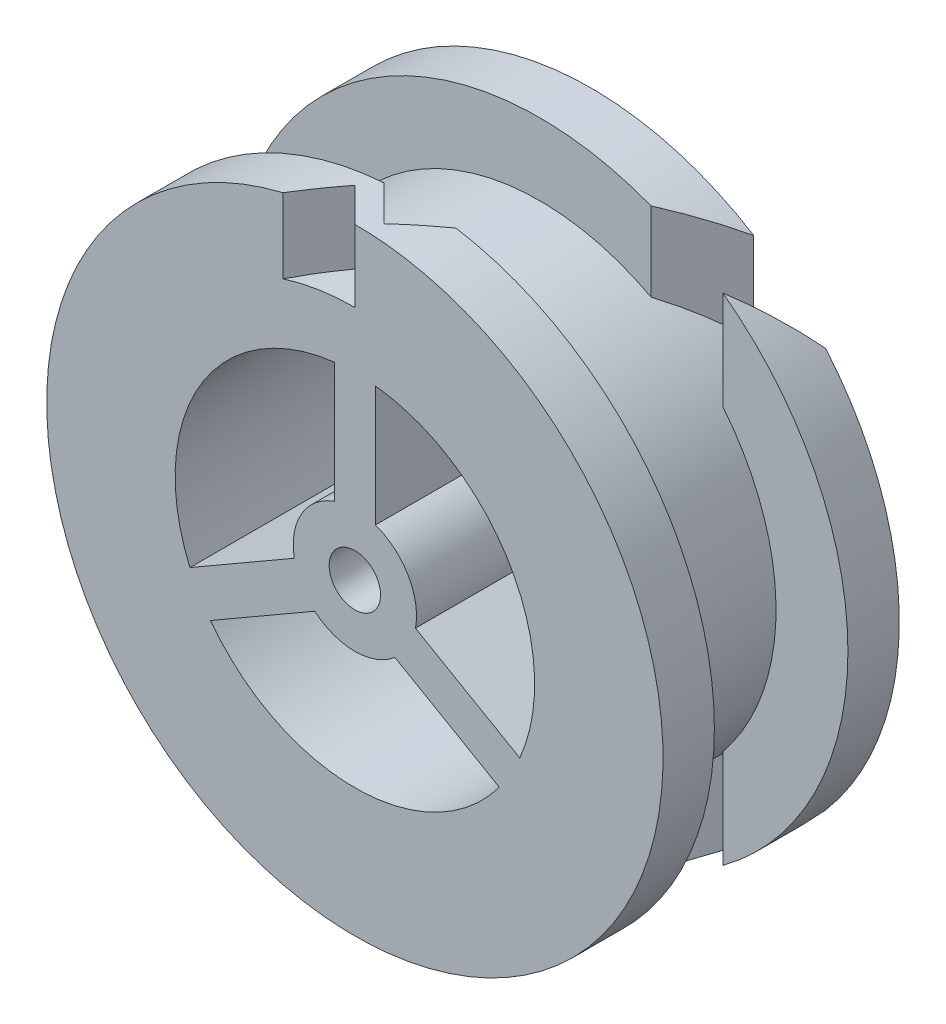
ISO-10303-21;
HEADER;
FILE_DESCRIPTION(('STEP AP214'),'2;1');
FILE_NAME('part.step','',(''),(''),'','','');
FILE_SCHEMA(('AUTOMOTIVE_DESIGN { 1 0 10303 214 1 1 1 1 }'));
ENDSEC;
DATA;
#1=APPLICATION_CONTEXT('core data for automotive mechanical design processes');
#2=APPLICATION_PROTOCOL_DEFINITION('international standard','automotive_design',2000,#1);
#3=PRODUCT_CONTEXT('',#1,'mechanical');
#4=PRODUCT('Part','Part','',(#3));
#5=PRODUCT_RELATED_PRODUCT_CATEGORY('part','',(#4));
#6=PRODUCT_DEFINITION_FORMATION('','',#4);
#7=PRODUCT_DEFINITION_CONTEXT('part definition',#1,'design');
#8=PRODUCT_DEFINITION('design','',#6,#7);
#9=PRODUCT_DEFINITION_SHAPE('','',#8);
#10=(LENGTH_UNIT() NAMED_UNIT(*) SI_UNIT(.MILLI.,.METRE.));
#11=(NAMED_UNIT(*) PLANE_ANGLE_UNIT() SI_UNIT($,.RADIAN.));
#12=(NAMED_UNIT(*) SI_UNIT($,.STERADIAN.) SOLID_ANGLE_UNIT());
#13=UNCERTAINTY_MEASURE_WITH_UNIT(LENGTH_MEASURE(1.E-05),#10,'distance_accuracy_value','');
#14=(GEOMETRIC_REPRESENTATION_CONTEXT(3) GLOBAL_UNCERTAINTY_ASSIGNED_CONTEXT((#13)) GLOBAL_UNIT_ASSIGNED_CONTEXT((#10,
#11,#12)) REPRESENTATION_CONTEXT('',''));
#15=CARTESIAN_POINT('',(0.,0.,0.));
#16=DIRECTION('',(0.,0.,1.));
#17=DIRECTION('',(1.,0.,0.));
#18=AXIS2_PLACEMENT_3D('',#15,#16,#17);
#19=CARTESIAN_POINT('',(0.,0.,-11.5));
#20=DIRECTION('',(0.,0.,1.));
#21=DIRECTION('',(1.,0.,0.));
#22=AXIS2_PLACEMENT_3D('',#19,#20,#21);
#23=CYLINDRICAL_SURFACE('',#22,30.);
#24=CARTESIAN_POINT('',(0.,0.,4.32842712474612));
#25=DIRECTION('',(-0.707106781186553,0.,-0.707106781186542));
#26=DIRECTION('',(-0.707106781186542,0.,0.707106781186553));
#27=AXIS2_PLACEMENT_3D('',#24,#25,#26);
#28=ELLIPSE('',#27,42.4264068711932,30.);
#29=CARTESIAN_POINT('',(10.828427124746,-27.977583276689,-6.50000000000001));
#30=VERTEX_POINT('',#29);
#31=CARTESIAN_POINT('',(15.8284271247459,-25.4845226511428,-11.5));
#32=VERTEX_POINT('',#31);
#33=EDGE_CURVE('E537',#30,#32,#28,.F.);
#34=ORIENTED_EDGE('',*,*,#33,.F.);
#35=CARTESIAN_POINT('',(0.,0.,-6.50000000000001));
#36=DIRECTION('',(0.,0.,1.));
#37=DIRECTION('',(1.,0.,0.));
#38=AXIS2_PLACEMENT_3D('',#35,#36,#37);
#39=CIRCLE('',#38,30.);
#40=CARTESIAN_POINT('',(10.828427124746,27.977583276689,-6.50000000000001));
#41=VERTEX_POINT('',#40);
#42=EDGE_CURVE('E349',#30,#41,#39,.F.);
#43=ORIENTED_EDGE('',*,*,#42,.T.);
#44=CARTESIAN_POINT('',(15.8284271247459,25.4845226511428,-11.5));
#45=VERTEX_POINT('',#44);
#46=EDGE_CURVE('E541',#45,#41,#28,.F.);
#47=ORIENTED_EDGE('',*,*,#46,.F.);
#48=CARTESIAN_POINT('',(0.,0.,-11.5));
#49=DIRECTION('',(0.,0.,1.));
#50=DIRECTION('',(1.,0.,0.));
#51=AXIS2_PLACEMENT_3D('',#48,#49,#50);
#52=CIRCLE('',#51,30.);
#53=EDGE_CURVE('E293',#45,#32,#52,.T.);
#54=ORIENTED_EDGE('',*,*,#53,.T.);
#55=EDGE_LOOP('',(#34,#43,#47,#54));
#56=FACE_BOUND('',#55,.T.);
#57=ADVANCED_FACE('F39',(#56),#23,.T.);
#58=CARTESIAN_POINT('',(0.,0.,-6.5));
#59=DIRECTION('',(0.,0.,1.));
#60=DIRECTION('',(1.,0.,0.));
#61=AXIS2_PLACEMENT_3D('',#58,#59,#60);
#62=PLANE('',#61);
#63=DIRECTION('',(0.,-1.,0.));
#64=VECTOR('',#63,1.);
#65=CARTESIAN_POINT('',(10.828427124746,0.,-6.5));
#66=LINE('',#65,#64);
#67=CARTESIAN_POINT('',(10.828427124746,20.2915047742661,-6.50000000000001));
#68=VERTEX_POINT('',#67);
#69=EDGE_CURVE('E538',#41,#68,#66,.T.);
#70=ORIENTED_EDGE('',*,*,#69,.F.);
#71=ORIENTED_EDGE('',*,*,#42,.F.);
#72=CARTESIAN_POINT('',(10.828427124746,-20.2915047742661,-6.50000000000001));
#73=VERTEX_POINT('',#72);
#74=EDGE_CURVE('E535',#73,#30,#66,.T.);
#75=ORIENTED_EDGE('',*,*,#74,.F.);
#76=CARTESIAN_POINT('',(0.,0.,-6.50000000000001));
#77=DIRECTION('',(0.,0.,1.));
#78=DIRECTION('',(1.,0.,0.));
#79=AXIS2_PLACEMENT_3D('',#76,#77,#78);
#80=CIRCLE('',#79,23.);
#81=EDGE_CURVE('E353',#73,#68,#80,.F.);
#82=ORIENTED_EDGE('',*,*,#81,.T.);
#83=EDGE_LOOP('',(#70,#71,#75,#82));
#84=FACE_BOUND('',#83,.T.);
#85=ADVANCED_FACE('F435',(#84),#62,.T.);
#86=CARTESIAN_POINT('',(0.,0.,6.5));
#87=DIRECTION('',(0.,0.,1.));
#88=DIRECTION('',(1.,0.,0.));
#89=AXIS2_PLACEMENT_3D('',#86,#87,#88);
#90=PLANE('',#89);
#91=CARTESIAN_POINT('',(0.,0.,6.50000000000001));
#92=DIRECTION('',(0.,0.,1.));
#93=DIRECTION('',(1.,0.,0.));
#94=AXIS2_PLACEMENT_3D('',#91,#92,#93);
#95=CIRCLE('',#94,30.);
#96=CARTESIAN_POINT('',(-2.17157287525385,29.9213012960242,6.50000000000001));
#97=VERTEX_POINT('',#96);
#98=CARTESIAN_POINT('',(-2.17157287525385,-29.9213012960242,6.50000000000001));
#99=VERTEX_POINT('',#98);
#100=EDGE_CURVE('E340',#97,#99,#95,.T.);
#101=ORIENTED_EDGE('',*,*,#100,.F.);
#102=DIRECTION('',(0.,1.,0.));
#103=VECTOR('',#102,1.);
#104=CARTESIAN_POINT('',(-2.17157287525385,-30.001,6.50000000000001));
#105=LINE('',#104,#103);
#106=CARTESIAN_POINT('',(-2.17157287525385,22.8972546661704,6.50000000000001));
#107=VERTEX_POINT('',#106);
#108=EDGE_CURVE('E499',#107,#97,#105,.T.);
#109=ORIENTED_EDGE('',*,*,#108,.F.);
#110=CARTESIAN_POINT('',(0.,0.,6.50000000000001));
#111=DIRECTION('',(0.,0.,1.));
#112=DIRECTION('',(1.,0.,0.));
#113=AXIS2_PLACEMENT_3D('',#110,#111,#112);
#114=CIRCLE('',#113,23.);
#115=CARTESIAN_POINT('',(-2.17157287525385,-22.8972546661704,6.50000000000001));
#116=VERTEX_POINT('',#115);
#117=EDGE_CURVE('E341',#107,#116,#114,.T.);
#118=ORIENTED_EDGE('',*,*,#117,.T.);
#119=DIRECTION('',(0.,-1.,0.));
#120=VECTOR('',#119,1.);
#121=CARTESIAN_POINT('',(-2.17157287525386,0.,6.5));
#122=LINE('',#121,#120);
#123=EDGE_CURVE('E296',#116,#99,#122,.T.);
#124=ORIENTED_EDGE('',*,*,#123,.T.);
#125=EDGE_LOOP('',(#101,#109,#118,#124));
#126=FACE_BOUND('',#125,.T.);
#127=ADVANCED_FACE('F442',(#126),#90,.F.);
#128=CARTESIAN_POINT('',(0.,0.,11.3284271247462));
#129=DIRECTION('',(0.707106781186553,0.,0.707106781186542));
#130=DIRECTION('',(-0.707106781186542,0.,0.707106781186553));
#131=AXIS2_PLACEMENT_3D('',#128,#129,#130);
#132=ELLIPSE('',#131,42.4264068711932,30.);
#133=CARTESIAN_POINT('',(17.8284271247459,24.1277265041202,-6.50000000000001));
#134=VERTEX_POINT('',#133);
#135=CARTESIAN_POINT('',(22.8284271247459,19.4644012240338,-11.5));
#136=VERTEX_POINT('',#135);
#137=EDGE_CURVE('E527',#134,#136,#132,.F.);
#138=ORIENTED_EDGE('',*,*,#137,.F.);
#139=CARTESIAN_POINT('',(17.8284271247459,-24.1277265041202,-6.50000000000001));
#140=VERTEX_POINT('',#139);
#141=EDGE_CURVE('E343',#134,#140,#39,.F.);
#142=ORIENTED_EDGE('',*,*,#141,.T.);
#143=CARTESIAN_POINT('',(22.8284271247459,-19.4644012240338,-11.5));
#144=VERTEX_POINT('',#143);
#145=EDGE_CURVE('E531',#144,#140,#132,.F.);
#146=ORIENTED_EDGE('',*,*,#145,.F.);
#147=EDGE_CURVE('E290',#144,#136,#52,.T.);
#148=ORIENTED_EDGE('',*,*,#147,.T.);
#149=EDGE_LOOP('',(#138,#142,#146,#148));
#150=FACE_BOUND('',#149,.T.);
#151=ADVANCED_FACE('F438',(#150),#23,.T.);
#152=CARTESIAN_POINT('',(-1.00000000000001,1.73205080756888,-11.5));
#153=DIRECTION('',(0.500000000000004,-0.866025403784436,0.));
#154=DIRECTION('',(0.866025403784436,0.500000000000005,0.));
#155=AXIS2_PLACEMENT_3D('',#152,#153,#154);
#156=PLANE('',#155);
#157=DIRECTION('',(0.,0.,1.));
#158=VECTOR('',#157,1.);
#159=CARTESIAN_POINT('',(-16.0561449249135,-6.96061851778806,-11.5));
#160=LINE('',#159,#158);
#161=CARTESIAN_POINT('',(-16.0561449249135,-6.96061851778806,-11.5));
#162=VERTEX_POINT('',#161);
#163=CARTESIAN_POINT('',(-16.0561449249135,-6.96061851778806,11.5));
#164=VERTEX_POINT('',#163);
#165=EDGE_CURVE('E301',#162,#164,#160,.T.);
#166=ORIENTED_EDGE('',*,*,#165,.T.);
#167=DIRECTION('',(0.866025403784436,0.500000000000005,0.));
#168=VECTOR('',#167,1.);
#169=CARTESIAN_POINT('',(-1.00000000000001,1.73205080756888,11.5));
#170=LINE('',#169,#168);
#171=CARTESIAN_POINT('',(-5.89897948556635,-1.09637631717734,11.5));
#172=VERTEX_POINT('',#171);
#173=EDGE_CURVE('E374',#164,#172,#170,.T.);
#174=ORIENTED_EDGE('',*,*,#173,.T.);
#175=DIRECTION('',(0.,0.,1.));
#176=VECTOR('',#175,1.);
#177=CARTESIAN_POINT('',(-5.89897948556635,-1.09637631717734,-11.5));
#178=LINE('',#177,#176);
#179=CARTESIAN_POINT('',(-5.89897948556635,-1.09637631717734,-11.5));
#180=VERTEX_POINT('',#179);
#181=EDGE_CURVE('E294',#180,#172,#178,.T.);
#182=ORIENTED_EDGE('',*,*,#181,.F.);
#183=DIRECTION('',(0.866025403784436,0.500000000000005,0.));
#184=VECTOR('',#183,1.);
#185=CARTESIAN_POINT('',(-1.00000000000001,1.73205080756888,-11.5));
#186=LINE('',#185,#184);
#187=EDGE_CURVE('E286',#162,#180,#186,.T.);
#188=ORIENTED_EDGE('',*,*,#187,.F.);
#189=EDGE_LOOP('',(#166,#174,#182,#188));
#190=FACE_BOUND('',#189,.T.);
#191=ADVANCED_FACE('F414',(#190),#156,.F.);
#192=CARTESIAN_POINT('',(0.,0.,-11.5));
#193=DIRECTION('',(0.,0.,1.));
#194=DIRECTION('',(1.,0.,0.));
#195=AXIS2_PLACEMENT_3D('',#192,#193,#194);
#196=CYLINDRICAL_SURFACE('',#195,6.);
#197=ORIENTED_EDGE('',*,*,#181,.T.);
#198=CARTESIAN_POINT('',(0.,0.,11.5));
#199=DIRECTION('',(0.,0.,1.));
#200=DIRECTION('',(1.,0.,0.));
#201=AXIS2_PLACEMENT_3D('',#198,#199,#200);
#202=CIRCLE('',#201,6.);
#203=CARTESIAN_POINT('',(-2.,5.65685424949238,11.5));
#204=VERTEX_POINT('',#203);
#205=EDGE_CURVE('E256',#204,#172,#202,.T.);
#206=ORIENTED_EDGE('',*,*,#205,.F.);
#207=DIRECTION('',(0.,0.,1.));
#208=VECTOR('',#207,1.);
#209=CARTESIAN_POINT('',(-2.,5.65685424949238,-11.5));
#210=LINE('',#209,#208);
#211=CARTESIAN_POINT('',(-2.,5.65685424949238,-11.5));
#212=VERTEX_POINT('',#211);
#213=EDGE_CURVE('E297',#212,#204,#210,.T.);
#214=ORIENTED_EDGE('',*,*,#213,.F.);
#215=CARTESIAN_POINT('',(0.,0.,-11.5));
#216=DIRECTION('',(0.,0.,1.));
#217=DIRECTION('',(1.,0.,0.));
#218=AXIS2_PLACEMENT_3D('',#215,#216,#217);
#219=CIRCLE('',#218,6.);
#220=EDGE_CURVE('E276',#212,#180,#219,.T.);
#221=ORIENTED_EDGE('',*,*,#220,.T.);
#222=EDGE_LOOP('',(#197,#206,#214,#221));
#223=FACE_BOUND('',#222,.T.);
#224=ADVANCED_FACE('F418',(#223),#196,.T.);
#225=CARTESIAN_POINT('',(-2.,0.,-11.5));
#226=DIRECTION('',(1.,0.,0.));
#227=DIRECTION('',(0.,0.,-1.));
#228=AXIS2_PLACEMENT_3D('',#225,#226,#227);
#229=PLANE('',#228);
#230=ORIENTED_EDGE('',*,*,#213,.T.);
#231=DIRECTION('',(0.,1.,0.));
#232=VECTOR('',#231,1.);
#233=CARTESIAN_POINT('',(-2.,0.,11.5));
#234=LINE('',#233,#232);
#235=CARTESIAN_POINT('',(-2.,17.3853386507137,11.5));
#236=VERTEX_POINT('',#235);
#237=EDGE_CURVE('E264',#204,#236,#234,.T.);
#238=ORIENTED_EDGE('',*,*,#237,.T.);
#239=DIRECTION('',(0.,0.,1.));
#240=VECTOR('',#239,1.);
#241=CARTESIAN_POINT('',(-2.,17.3853386507137,-11.5));
#242=LINE('',#241,#240);
#243=CARTESIAN_POINT('',(-2.,17.3853386507137,-11.5));
#244=VERTEX_POINT('',#243);
#245=EDGE_CURVE('E299',#244,#236,#242,.T.);
#246=ORIENTED_EDGE('',*,*,#245,.F.);
#247=DIRECTION('',(0.,1.,0.));
#248=VECTOR('',#247,1.);
#249=CARTESIAN_POINT('',(-2.,0.,-11.5));
#250=LINE('',#249,#248);
#251=EDGE_CURVE('E288',#212,#244,#250,.T.);
#252=ORIENTED_EDGE('',*,*,#251,.F.);
#253=EDGE_LOOP('',(#230,#238,#246,#252));
#254=FACE_BOUND('',#253,.T.);
#255=ADVANCED_FACE('F745',(#254),#229,.F.);
#256=CARTESIAN_POINT('',(0.,0.,-11.5));
#257=DIRECTION('',(0.,0.,1.));
#258=DIRECTION('',(1.,0.,0.));
#259=AXIS2_PLACEMENT_3D('',#256,#257,#258);
#260=CYLINDRICAL_SURFACE('',#259,17.5);
#261=DIRECTION('',(0.,0.,1.));
#262=VECTOR('',#261,1.);
#263=CARTESIAN_POINT('',(-14.0561449249135,-10.4247201329258,-11.5));
#264=LINE('',#263,#262);
#265=CARTESIAN_POINT('',(-14.0561449249135,-10.4247201329258,-11.5));
#266=VERTEX_POINT('',#265);
#267=CARTESIAN_POINT('',(-14.0561449249135,-10.4247201329258,11.5));
#268=VERTEX_POINT('',#267);
#269=EDGE_CURVE('E309',#266,#268,#264,.T.);
#270=ORIENTED_EDGE('',*,*,#269,.T.);
#271=CARTESIAN_POINT('',(0.,0.,11.5));
#272=DIRECTION('',(0.,0.,1.));
#273=DIRECTION('',(1.,0.,0.));
#274=AXIS2_PLACEMENT_3D('',#271,#272,#273);
#275=CIRCLE('',#274,17.5);
#276=CARTESIAN_POINT('',(14.0561449249136,-10.4247201329257,11.5));
#277=VERTEX_POINT('',#276);
#278=EDGE_CURVE('E359',#268,#277,#275,.T.);
#279=ORIENTED_EDGE('',*,*,#278,.T.);
#280=DIRECTION('',(0.,0.,1.));
#281=VECTOR('',#280,1.);
#282=CARTESIAN_POINT('',(14.0561449249136,-10.4247201329257,-11.5));
#283=LINE('',#282,#281);
#284=CARTESIAN_POINT('',(14.0561449249136,-10.4247201329257,-11.5));
#285=VERTEX_POINT('',#284);
#286=EDGE_CURVE('E303',#285,#277,#283,.T.);
#287=ORIENTED_EDGE('',*,*,#286,.F.);
#288=CARTESIAN_POINT('',(0.,0.,-11.5));
#289=DIRECTION('',(0.,0.,1.));
#290=DIRECTION('',(1.,0.,0.));
#291=AXIS2_PLACEMENT_3D('',#288,#289,#290);
#292=CIRCLE('',#291,17.5);
#293=EDGE_CURVE('E262',#266,#285,#292,.T.);
#294=ORIENTED_EDGE('',*,*,#293,.F.);
#295=EDGE_LOOP('',(#270,#279,#287,#294));
#296=FACE_BOUND('',#295,.T.);
#297=ADVANCED_FACE('F389',(#296),#260,.F.);
#298=CARTESIAN_POINT('',(-0.999999999999993,-1.73205080756888,-11.5));
#299=DIRECTION('',(0.499999999999998,0.86602540378444,0.));
#300=DIRECTION('',(-0.86602540378444,0.499999999999998,0.));
#301=AXIS2_PLACEMENT_3D('',#298,#299,#300);
#302=PLANE('',#301);
#303=ORIENTED_EDGE('',*,*,#286,.T.);
#304=DIRECTION('',(-0.86602540378444,0.499999999999998,0.));
#305=VECTOR('',#304,1.);
#306=CARTESIAN_POINT('',(-0.999999999999993,-1.73205080756888,11.5));
#307=LINE('',#306,#305);
#308=CARTESIAN_POINT('',(3.89897948556637,-4.56047793231505,11.5));
#309=VERTEX_POINT('',#308);
#310=EDGE_CURVE('E369',#277,#309,#307,.T.);
#311=ORIENTED_EDGE('',*,*,#310,.T.);
#312=DIRECTION('',(0.,0.,1.));
#313=VECTOR('',#312,1.);
#314=CARTESIAN_POINT('',(3.89897948556637,-4.56047793231505,-11.5));
#315=LINE('',#314,#313);
#316=CARTESIAN_POINT('',(3.89897948556637,-4.56047793231505,-11.5));
#317=VERTEX_POINT('',#316);
#318=EDGE_CURVE('E305',#317,#309,#315,.T.);
#319=ORIENTED_EDGE('',*,*,#318,.F.);
#320=DIRECTION('',(-0.86602540378444,0.499999999999998,0.));
#321=VECTOR('',#320,1.);
#322=CARTESIAN_POINT('',(-0.999999999999993,-1.73205080756888,-11.5));
#323=LINE('',#322,#321);
#324=EDGE_CURVE('E281',#285,#317,#323,.T.);
#325=ORIENTED_EDGE('',*,*,#324,.F.);
#326=EDGE_LOOP('',(#303,#311,#319,#325));
#327=FACE_BOUND('',#326,.T.);
#328=ADVANCED_FACE('F399',(#327),#302,.F.);
#329=ORIENTED_EDGE('',*,*,#318,.T.);
#330=CARTESIAN_POINT('',(-3.89897948556633,-4.56047793231509,11.5));
#331=VERTEX_POINT('',#330);
#332=EDGE_CURVE('E266',#331,#309,#202,.T.);
#333=ORIENTED_EDGE('',*,*,#332,.F.);
#334=DIRECTION('',(0.,0.,1.));
#335=VECTOR('',#334,1.);
#336=CARTESIAN_POINT('',(-3.89897948556633,-4.56047793231509,-11.5));
#337=LINE('',#336,#335);
#338=CARTESIAN_POINT('',(-3.89897948556633,-4.56047793231509,-11.5));
#339=VERTEX_POINT('',#338);
#340=EDGE_CURVE('E307',#339,#331,#337,.T.);
#341=ORIENTED_EDGE('',*,*,#340,.F.);
#342=EDGE_CURVE('E277',#339,#317,#219,.T.);
#343=ORIENTED_EDGE('',*,*,#342,.T.);
#344=EDGE_LOOP('',(#329,#333,#341,#343));
#345=FACE_BOUND('',#344,.T.);
#346=ADVANCED_FACE('F420',(#345),#196,.T.);
#347=DIRECTION('',(0.,0.,1.));
#348=VECTOR('',#347,1.);
#349=CARTESIAN_POINT('',(16.0561449249136,-6.96061851778794,-11.5));
#350=LINE('',#349,#348);
#351=CARTESIAN_POINT('',(16.0561449249136,-6.96061851778794,-11.5));
#352=VERTEX_POINT('',#351);
#353=CARTESIAN_POINT('',(16.0561449249136,-6.96061851778794,11.5));
#354=VERTEX_POINT('',#353);
#355=EDGE_CURVE('E317',#352,#354,#350,.T.);
#356=ORIENTED_EDGE('',*,*,#355,.T.);
#357=CARTESIAN_POINT('',(2.,17.3853386507137,11.5));
#358=VERTEX_POINT('',#357);
#359=EDGE_CURVE('E354',#354,#358,#275,.T.);
#360=ORIENTED_EDGE('',*,*,#359,.T.);
#361=DIRECTION('',(0.,0.,1.));
#362=VECTOR('',#361,1.);
#363=CARTESIAN_POINT('',(2.,17.3853386507137,-11.5));
#364=LINE('',#363,#362);
#365=CARTESIAN_POINT('',(2.,17.3853386507137,-11.5));
#366=VERTEX_POINT('',#365);
#367=EDGE_CURVE('E311',#366,#358,#364,.T.);
#368=ORIENTED_EDGE('',*,*,#367,.F.);
#369=EDGE_CURVE('E255',#352,#366,#292,.T.);
#370=ORIENTED_EDGE('',*,*,#369,.F.);
#371=EDGE_LOOP('',(#356,#360,#368,#370));
#372=FACE_BOUND('',#371,.T.);
#373=ADVANCED_FACE('F698',(#372),#260,.F.);
#374=CARTESIAN_POINT('',(2.,0.,-11.5));
#375=DIRECTION('',(-1.,0.,0.));
#376=DIRECTION('',(0.,-1.,0.));
#377=AXIS2_PLACEMENT_3D('',#374,#375,#376);
#378=PLANE('',#377);
#379=ORIENTED_EDGE('',*,*,#367,.T.);
#380=DIRECTION('',(0.,-1.,0.));
#381=VECTOR('',#380,1.);
#382=CARTESIAN_POINT('',(2.,0.,11.5));
#383=LINE('',#382,#381);
#384=CARTESIAN_POINT('',(2.,5.65685424949238,11.5));
#385=VERTEX_POINT('',#384);
#386=EDGE_CURVE('E363',#358,#385,#383,.T.);
#387=ORIENTED_EDGE('',*,*,#386,.T.);
#388=DIRECTION('',(0.,0.,1.));
#389=VECTOR('',#388,1.);
#390=CARTESIAN_POINT('',(2.,5.65685424949238,-11.5));
#391=LINE('',#390,#389);
#392=CARTESIAN_POINT('',(2.,5.65685424949238,-11.5));
#393=VERTEX_POINT('',#392);
#394=EDGE_CURVE('E313',#393,#385,#391,.T.);
#395=ORIENTED_EDGE('',*,*,#394,.F.);
#396=DIRECTION('',(0.,-1.,0.));
#397=VECTOR('',#396,1.);
#398=CARTESIAN_POINT('',(2.,0.,-11.5));
#399=LINE('',#398,#397);
#400=EDGE_CURVE('E275',#366,#393,#399,.T.);
#401=ORIENTED_EDGE('',*,*,#400,.F.);
#402=EDGE_LOOP('',(#379,#387,#395,#401));
#403=FACE_BOUND('',#402,.T.);
#404=ADVANCED_FACE('F706',(#403),#378,.F.);
#405=ORIENTED_EDGE('',*,*,#394,.T.);
#406=CARTESIAN_POINT('',(5.89897948556636,-1.09637631717729,11.5));
#407=VERTEX_POINT('',#406);
#408=EDGE_CURVE('E267',#407,#385,#202,.T.);
#409=ORIENTED_EDGE('',*,*,#408,.F.);
#410=DIRECTION('',(0.,0.,1.));
#411=VECTOR('',#410,1.);
#412=CARTESIAN_POINT('',(5.89897948556636,-1.09637631717729,-11.5));
#413=LINE('',#412,#411);
#414=CARTESIAN_POINT('',(5.89897948556636,-1.09637631717729,-11.5));
#415=VERTEX_POINT('',#414);
#416=EDGE_CURVE('E315',#415,#407,#413,.T.);
#417=ORIENTED_EDGE('',*,*,#416,.F.);
#418=EDGE_CURVE('E272',#415,#393,#219,.T.);
#419=ORIENTED_EDGE('',*,*,#418,.T.);
#420=EDGE_LOOP('',(#405,#409,#417,#419));
#421=FACE_BOUND('',#420,.T.);
#422=ADVANCED_FACE('F696',(#421),#196,.T.);
#423=ORIENTED_EDGE('',*,*,#245,.T.);
#424=EDGE_CURVE('E358',#236,#164,#275,.T.);
#425=ORIENTED_EDGE('',*,*,#424,.T.);
#426=ORIENTED_EDGE('',*,*,#165,.F.);
#427=EDGE_CURVE('E261',#244,#162,#292,.T.);
#428=ORIENTED_EDGE('',*,*,#427,.F.);
#429=EDGE_LOOP('',(#423,#425,#426,#428));
#430=FACE_BOUND('',#429,.T.);
#431=ADVANCED_FACE('F413',(#430),#260,.F.);
#432=CARTESIAN_POINT('',(0.,0.,-11.5));
#433=DIRECTION('',(0.,0.,1.));
#434=DIRECTION('',(1.,0.,0.));
#435=AXIS2_PLACEMENT_3D('',#432,#433,#434);
#436=CYLINDRICAL_SURFACE('',#435,2.5);
#437=CARTESIAN_POINT('',(0.,0.,-11.5));
#438=DIRECTION('',(0.,0.,1.));
#439=DIRECTION('',(1.,0.,0.));
#440=AXIS2_PLACEMENT_3D('',#437,#438,#439);
#441=CIRCLE('',#440,2.5);
#442=CARTESIAN_POINT('',(2.5,0.,-11.5));
#443=VERTEX_POINT('',#442);
#444=EDGE_CURVE('E283',#443,#443,#441,.T.);
#445=ORIENTED_EDGE('',*,*,#444,.F.);
#446=EDGE_LOOP('',(#445));
#447=FACE_BOUND('',#446,.T.);
#448=CARTESIAN_POINT('',(0.,0.,11.5));
#449=DIRECTION('',(0.,0.,1.));
#450=DIRECTION('',(1.,0.,0.));
#451=AXIS2_PLACEMENT_3D('',#448,#449,#450);
#452=CIRCLE('',#451,2.5);
#453=CARTESIAN_POINT('',(2.5,0.,11.5));
#454=VERTEX_POINT('',#453);
#455=EDGE_CURVE('E372',#454,#454,#452,.T.);
#456=ORIENTED_EDGE('',*,*,#455,.T.);
#457=EDGE_LOOP('',(#456));
#458=FACE_BOUND('',#457,.T.);
#459=ADVANCED_FACE('F424',(#447,#458),#436,.F.);
#460=CARTESIAN_POINT('',(1.00000000000001,-1.73205080756887,-11.5));
#461=DIRECTION('',(-0.500000000000004,0.866025403784436,0.));
#462=DIRECTION('',(-0.866025403784436,-0.500000000000004,0.));
#463=AXIS2_PLACEMENT_3D('',#460,#461,#462);
#464=PLANE('',#463);
#465=ORIENTED_EDGE('',*,*,#340,.T.);
#466=DIRECTION('',(-0.866025403784436,-0.500000000000004,0.));
#467=VECTOR('',#466,1.);
#468=CARTESIAN_POINT('',(1.00000000000001,-1.73205080756887,11.5));
#469=LINE('',#468,#467);
#470=EDGE_CURVE('E366',#331,#268,#469,.T.);
#471=ORIENTED_EDGE('',*,*,#470,.T.);
#472=ORIENTED_EDGE('',*,*,#269,.F.);
#473=DIRECTION('',(-0.866025403784436,-0.500000000000004,0.));
#474=VECTOR('',#473,1.);
#475=CARTESIAN_POINT('',(1.00000000000001,-1.73205080756887,-11.5));
#476=LINE('',#475,#474);
#477=EDGE_CURVE('E279',#339,#266,#476,.T.);
#478=ORIENTED_EDGE('',*,*,#477,.F.);
#479=EDGE_LOOP('',(#465,#471,#472,#478));
#480=FACE_BOUND('',#479,.T.);
#481=ADVANCED_FACE('F422',(#480),#464,.F.);
#482=CARTESIAN_POINT('',(0.999999999999998,1.73205080756888,-11.5));
#483=DIRECTION('',(-0.499999999999998,-0.86602540378444,0.));
#484=DIRECTION('',(0.86602540378444,-0.499999999999998,0.));
#485=AXIS2_PLACEMENT_3D('',#482,#483,#484);
#486=PLANE('',#485);
#487=ORIENTED_EDGE('',*,*,#416,.T.);
#488=DIRECTION('',(0.86602540378444,-0.499999999999998,0.));
#489=VECTOR('',#488,1.);
#490=CARTESIAN_POINT('',(0.999999999999998,1.73205080756888,11.5));
#491=LINE('',#490,#489);
#492=EDGE_CURVE('E357',#407,#354,#491,.T.);
#493=ORIENTED_EDGE('',*,*,#492,.T.);
#494=ORIENTED_EDGE('',*,*,#355,.F.);
#495=DIRECTION('',(0.86602540378444,-0.499999999999998,0.));
#496=VECTOR('',#495,1.);
#497=CARTESIAN_POINT('',(0.999999999999998,1.73205080756888,-11.5));
#498=LINE('',#497,#496);
#499=EDGE_CURVE('E259',#415,#352,#498,.T.);
#500=ORIENTED_EDGE('',*,*,#499,.F.);
#501=EDGE_LOOP('',(#487,#493,#494,#500));
#502=FACE_BOUND('',#501,.T.);
#503=ADVANCED_FACE('F41',(#502),#486,.F.);
#504=CARTESIAN_POINT('',(0.,0.,11.5));
#505=DIRECTION('',(0.707106781186542,0.,-0.707106781186553));
#506=DIRECTION('',(0.707106781186553,0.,0.707106781186542));
#507=AXIS2_PLACEMENT_3D('',#504,#505,#506);
#508=ELLIPSE('',#507,42.4264068711925,30.);
#509=CARTESIAN_POINT('',(0.,30.,11.5));
#510=VERTEX_POINT('',#509);
#511=CARTESIAN_POINT('',(-3.50000000000004,29.7951338308792,8.00000000000001));
#512=VERTEX_POINT('',#511);
#513=EDGE_CURVE('E234',#510,#512,#508,.F.);
#514=ORIENTED_EDGE('',*,*,#513,.F.);
#515=CARTESIAN_POINT('',(0.,0.,11.5));
#516=DIRECTION('',(0.,0.,1.));
#517=DIRECTION('',(1.,0.,0.));
#518=AXIS2_PLACEMENT_3D('',#515,#516,#517);
#519=CIRCLE('',#518,30.);
#520=CARTESIAN_POINT('',(-6.99999999999999,29.1719042916296,11.5));
#521=VERTEX_POINT('',#520);
#522=EDGE_CURVE('E249',#521,#510,#519,.T.);
#523=ORIENTED_EDGE('',*,*,#522,.F.);
#524=CARTESIAN_POINT('',(0.,0.,4.49999999999991));
#525=DIRECTION('',(-0.707106781186553,0.,-0.707106781186542));
#526=DIRECTION('',(-0.707106781186542,0.,0.707106781186553));
#527=AXIS2_PLACEMENT_3D('',#524,#525,#526);
#528=ELLIPSE('',#527,42.4264068711932,30.);
#529=EDGE_CURVE('E250',#512,#521,#528,.F.);
#530=ORIENTED_EDGE('',*,*,#529,.F.);
#531=EDGE_LOOP('',(#514,#523,#530));
#532=FACE_BOUND('',#531,.T.);
#533=CARTESIAN_POINT('',(0.,0.,8.67157287525383));
#534=DIRECTION('',(-0.707106781186542,0.,0.707106781186553));
#535=DIRECTION('',(0.707106781186553,0.,0.707106781186542));
#536=AXIS2_PLACEMENT_3D('',#533,#534,#535);
#537=ELLIPSE('',#536,42.4264068711925,30.);
#538=CARTESIAN_POINT('',(1.32842712474619,29.9705735910115,10.));
#539=VERTEX_POINT('',#538);
#540=EDGE_CURVE('E545',#97,#539,#537,.F.);
#541=ORIENTED_EDGE('',*,*,#540,.F.);
#542=ORIENTED_EDGE('',*,*,#100,.T.);
#543=CARTESIAN_POINT('',(0.,0.,8.67157287525383));
#544=DIRECTION('',(-0.707106781186542,0.,0.707106781186553));
#545=DIRECTION('',(0.707106781186553,0.,0.707106781186542));
#546=AXIS2_PLACEMENT_3D('',#543,#544,#545);
#547=ELLIPSE('',#546,42.4264068711925,30.);
#548=CARTESIAN_POINT('',(1.32842712474619,-29.9705735910116,10.));
#549=VERTEX_POINT('',#548);
#550=EDGE_CURVE('E522',#549,#99,#547,.F.);
#551=ORIENTED_EDGE('',*,*,#550,.F.);
#552=CARTESIAN_POINT('',(0.,0.,11.3284271247462));
#553=DIRECTION('',(0.707106781186553,0.,0.707106781186542));
#554=DIRECTION('',(-0.707106781186542,0.,0.707106781186553));
#555=AXIS2_PLACEMENT_3D('',#552,#553,#554);
#556=ELLIPSE('',#555,42.4264068711932,30.);
#557=CARTESIAN_POINT('',(4.82842712474614,-29.6088887245201,6.50000000000001));
#558=VERTEX_POINT('',#557);
#559=EDGE_CURVE('E339',#558,#549,#556,.F.);
#560=ORIENTED_EDGE('',*,*,#559,.F.);
#561=CARTESIAN_POINT('',(4.82842712474614,29.6088887245201,6.50000000000001));
#562=VERTEX_POINT('',#561);
#563=EDGE_CURVE('E331',#558,#562,#95,.T.);
#564=ORIENTED_EDGE('',*,*,#563,.T.);
#565=EDGE_CURVE('E337',#539,#562,#556,.F.);
#566=ORIENTED_EDGE('',*,*,#565,.F.);
#567=EDGE_LOOP('',(#541,#542,#551,#560,#564,#566));
#568=FACE_BOUND('',#567,.T.);
#569=ADVANCED_FACE('F247',(#532,#568),#23,.T.);
#570=CARTESIAN_POINT('',(0.,0.,-11.5));
#571=DIRECTION('',(0.,0.,1.));
#572=DIRECTION('',(1.,0.,0.));
#573=AXIS2_PLACEMENT_3D('',#570,#571,#572);
#574=PLANE('',#573);
#575=ORIENTED_EDGE('',*,*,#53,.F.);
#576=DIRECTION('',(0.,-1.,0.));
#577=VECTOR('',#576,1.);
#578=CARTESIAN_POINT('',(15.8284271247459,0.,-11.5));
#579=LINE('',#578,#577);
#580=CARTESIAN_POINT('',(15.8284271247459,16.6871475919825,-11.5));
#581=VERTEX_POINT('',#580);
#582=EDGE_CURVE('E544',#45,#581,#579,.T.);
#583=ORIENTED_EDGE('',*,*,#582,.T.);
#584=CARTESIAN_POINT('',(0.,0.,-11.5));
#585=DIRECTION('',(0.,0.,1.));
#586=DIRECTION('',(1.,0.,0.));
#587=AXIS2_PLACEMENT_3D('',#584,#585,#586);
#588=CIRCLE('',#587,23.);
#589=CARTESIAN_POINT('',(22.8284271247459,2.80408898042977,-11.5));
#590=VERTEX_POINT('',#589);
#591=EDGE_CURVE('E521',#590,#581,#588,.T.);
#592=ORIENTED_EDGE('',*,*,#591,.F.);
#593=DIRECTION('',(0.,1.,0.));
#594=VECTOR('',#593,1.);
#595=CARTESIAN_POINT('',(22.8284271247459,0.,-11.5));
#596=LINE('',#595,#594);
#597=EDGE_CURVE('E530',#590,#136,#596,.T.);
#598=ORIENTED_EDGE('',*,*,#597,.T.);
#599=ORIENTED_EDGE('',*,*,#147,.F.);
#600=CARTESIAN_POINT('',(22.8284271247459,-2.80408898042977,-11.5));
#601=VERTEX_POINT('',#600);
#602=EDGE_CURVE('E534',#144,#601,#596,.T.);
#603=ORIENTED_EDGE('',*,*,#602,.T.);
#604=CARTESIAN_POINT('',(15.8284271247459,-16.6871475919825,-11.5));
#605=VERTEX_POINT('',#604);
#606=EDGE_CURVE('E519',#605,#601,#588,.T.);
#607=ORIENTED_EDGE('',*,*,#606,.F.);
#608=EDGE_CURVE('E540',#605,#32,#579,.T.);
#609=ORIENTED_EDGE('',*,*,#608,.T.);
#610=EDGE_LOOP('',(#575,#583,#592,#598,#599,#603,#607,#609));
#611=FACE_BOUND('',#610,.T.);
#612=ORIENTED_EDGE('',*,*,#369,.T.);
#613=ORIENTED_EDGE('',*,*,#400,.T.);
#614=ORIENTED_EDGE('',*,*,#418,.F.);
#615=ORIENTED_EDGE('',*,*,#499,.T.);
#616=EDGE_LOOP('',(#612,#613,#614,#615));
#617=FACE_BOUND('',#616,.T.);
#618=ORIENTED_EDGE('',*,*,#293,.T.);
#619=ORIENTED_EDGE('',*,*,#324,.T.);
#620=ORIENTED_EDGE('',*,*,#342,.F.);
#621=ORIENTED_EDGE('',*,*,#477,.T.);
#622=EDGE_LOOP('',(#618,#619,#620,#621));
#623=FACE_BOUND('',#622,.T.);
#624=ORIENTED_EDGE('',*,*,#444,.T.);
#625=EDGE_LOOP('',(#624));
#626=FACE_BOUND('',#625,.T.);
#627=ORIENTED_EDGE('',*,*,#187,.T.);
#628=ORIENTED_EDGE('',*,*,#220,.F.);
#629=ORIENTED_EDGE('',*,*,#251,.T.);
#630=ORIENTED_EDGE('',*,*,#427,.T.);
#631=EDGE_LOOP('',(#627,#628,#629,#630));
#632=FACE_BOUND('',#631,.T.);
#633=ADVANCED_FACE('F404',(#611,#617,#623,#626,#632),#574,.F.);
#634=CARTESIAN_POINT('',(0.,0.,11.5));
#635=DIRECTION('',(0.,0.,1.));
#636=DIRECTION('',(1.,0.,0.));
#637=AXIS2_PLACEMENT_3D('',#634,#635,#636);
#638=PLANE('',#637);
#639=DIRECTION('',(0.,1.,0.));
#640=VECTOR('',#639,1.);
#641=CARTESIAN_POINT('',(0.,-30.001,11.5));
#642=LINE('',#641,#640);
#643=CARTESIAN_POINT('',(0.,23.,11.5));
#644=VERTEX_POINT('',#643);
#645=EDGE_CURVE('E230',#644,#510,#642,.T.);
#646=ORIENTED_EDGE('',*,*,#645,.F.);
#647=CARTESIAN_POINT('',(0.,0.,11.5));
#648=DIRECTION('',(0.,0.,1.));
#649=DIRECTION('',(1.,0.,0.));
#650=AXIS2_PLACEMENT_3D('',#647,#648,#649);
#651=CIRCLE('',#650,23.);
#652=CARTESIAN_POINT('',(-6.99999999999999,21.9089023002066,11.5));
#653=VERTEX_POINT('',#652);
#654=EDGE_CURVE('E496',#644,#653,#651,.T.);
#655=ORIENTED_EDGE('',*,*,#654,.T.);
#656=DIRECTION('',(0.,1.,0.));
#657=VECTOR('',#656,1.);
#658=CARTESIAN_POINT('',(-6.99999999999999,-30.001,11.5));
#659=LINE('',#658,#657);
#660=EDGE_CURVE('E54',#653,#521,#659,.T.);
#661=ORIENTED_EDGE('',*,*,#660,.T.);
#662=ORIENTED_EDGE('',*,*,#522,.T.);
#663=EDGE_LOOP('',(#646,#655,#661,#662));
#664=FACE_BOUND('',#663,.T.);
#665=ORIENTED_EDGE('',*,*,#359,.F.);
#666=ORIENTED_EDGE('',*,*,#492,.F.);
#667=ORIENTED_EDGE('',*,*,#408,.T.);
#668=ORIENTED_EDGE('',*,*,#386,.F.);
#669=EDGE_LOOP('',(#665,#666,#667,#668));
#670=FACE_BOUND('',#669,.T.);
#671=ORIENTED_EDGE('',*,*,#278,.F.);
#672=ORIENTED_EDGE('',*,*,#470,.F.);
#673=ORIENTED_EDGE('',*,*,#332,.T.);
#674=ORIENTED_EDGE('',*,*,#310,.F.);
#675=EDGE_LOOP('',(#671,#672,#673,#674));
#676=FACE_BOUND('',#675,.T.);
#677=ORIENTED_EDGE('',*,*,#455,.F.);
#678=EDGE_LOOP('',(#677));
#679=FACE_BOUND('',#678,.T.);
#680=ORIENTED_EDGE('',*,*,#173,.F.);
#681=ORIENTED_EDGE('',*,*,#424,.F.);
#682=ORIENTED_EDGE('',*,*,#237,.F.);
#683=ORIENTED_EDGE('',*,*,#205,.T.);
#684=EDGE_LOOP('',(#680,#681,#682,#683));
#685=FACE_BOUND('',#684,.T.);
#686=ADVANCED_FACE('F253',(#664,#670,#676,#679,#685),#638,.T.);
#687=CARTESIAN_POINT('',(0.,0.,-96.3528137423857));
#688=DIRECTION('',(0.,0.,1.));
#689=DIRECTION('',(1.,0.,0.));
#690=AXIS2_PLACEMENT_3D('',#687,#688,#689);
#691=CYLINDRICAL_SURFACE('',#690,23.);
#692=ORIENTED_EDGE('',*,*,#81,.F.);
#693=CARTESIAN_POINT('',(0.,0.,4.32842712474613));
#694=DIRECTION('',(-0.707106781186553,0.,-0.707106781186542));
#695=DIRECTION('',(-0.707106781186542,0.,0.707106781186553));
#696=AXIS2_PLACEMENT_3D('',#693,#694,#695);
#697=ELLIPSE('',#696,32.5269119345814,23.);
#698=EDGE_CURVE('E507',#605,#73,#697,.T.);
#699=ORIENTED_EDGE('',*,*,#698,.F.);
#700=ORIENTED_EDGE('',*,*,#606,.T.);
#701=CARTESIAN_POINT('',(0.,0.,11.3284271247462));
#702=DIRECTION('',(0.707106781186553,0.,0.707106781186542));
#703=DIRECTION('',(-0.707106781186542,0.,0.707106781186553));
#704=AXIS2_PLACEMENT_3D('',#701,#702,#703);
#705=ELLIPSE('',#704,32.5269119345814,23.);
#706=CARTESIAN_POINT('',(17.8284271247459,-14.5309045230372,-6.50000000000001));
#707=VERTEX_POINT('',#706);
#708=EDGE_CURVE('E508',#707,#601,#705,.T.);
#709=ORIENTED_EDGE('',*,*,#708,.F.);
#710=CARTESIAN_POINT('',(17.8284271247459,14.5309045230372,-6.50000000000001));
#711=VERTEX_POINT('',#710);
#712=EDGE_CURVE('E350',#711,#707,#80,.F.);
#713=ORIENTED_EDGE('',*,*,#712,.F.);
#714=EDGE_CURVE('E573',#590,#711,#705,.T.);
#715=ORIENTED_EDGE('',*,*,#714,.F.);
#716=ORIENTED_EDGE('',*,*,#591,.T.);
#717=EDGE_CURVE('E62',#68,#581,#697,.T.);
#718=ORIENTED_EDGE('',*,*,#717,.F.);
#719=EDGE_LOOP('',(#692,#699,#700,#709,#713,#715,#716,#718));
#720=FACE_BOUND('',#719,.T.);
#721=CARTESIAN_POINT('',(0.,0.,8.67157287525383));
#722=DIRECTION('',(-0.707106781186542,0.,0.707106781186553));
#723=DIRECTION('',(0.707106781186553,0.,0.707106781186542));
#724=AXIS2_PLACEMENT_3D('',#721,#722,#723);
#725=ELLIPSE('',#724,32.5269119345809,23.);
#726=CARTESIAN_POINT('',(1.32842712474619,-22.9616045034801,10.));
#727=VERTEX_POINT('',#726);
#728=EDGE_CURVE('E516',#116,#727,#725,.T.);
#729=ORIENTED_EDGE('',*,*,#728,.F.);
#730=ORIENTED_EDGE('',*,*,#117,.F.);
#731=CARTESIAN_POINT('',(1.32842712474619,22.9616045034801,10.));
#732=VERTEX_POINT('',#731);
#733=EDGE_CURVE('E513',#732,#107,#725,.T.);
#734=ORIENTED_EDGE('',*,*,#733,.F.);
#735=CARTESIAN_POINT('',(4.82842712474612,22.4874696553662,6.50000000000001));
#736=VERTEX_POINT('',#735);
#737=EDGE_CURVE('E509',#736,#732,#705,.T.);
#738=ORIENTED_EDGE('',*,*,#737,.F.);
#739=CARTESIAN_POINT('',(4.82842712474612,-22.4874696553662,6.50000000000001));
#740=VERTEX_POINT('',#739);
#741=EDGE_CURVE('E251',#740,#736,#114,.T.);
#742=ORIENTED_EDGE('',*,*,#741,.F.);
#743=EDGE_CURVE('E505',#727,#740,#705,.T.);
#744=ORIENTED_EDGE('',*,*,#743,.F.);
#745=EDGE_LOOP('',(#729,#730,#734,#738,#742,#744));
#746=FACE_BOUND('',#745,.T.);
#747=ADVANCED_FACE('F459',(#720,#746),#691,.T.);
#748=DIRECTION('',(0.,1.,0.));
#749=VECTOR('',#748,1.);
#750=CARTESIAN_POINT('',(17.8284271247459,0.,-6.5));
#751=LINE('',#750,#749);
#752=EDGE_CURVE('E528',#140,#707,#751,.T.);
#753=ORIENTED_EDGE('',*,*,#752,.F.);
#754=ORIENTED_EDGE('',*,*,#141,.F.);
#755=EDGE_CURVE('E525',#711,#134,#751,.T.);
#756=ORIENTED_EDGE('',*,*,#755,.F.);
#757=ORIENTED_EDGE('',*,*,#712,.T.);
#758=EDGE_LOOP('',(#753,#754,#756,#757));
#759=FACE_BOUND('',#758,.T.);
#760=ADVANCED_FACE('F445',(#759),#62,.T.);
#761=ORIENTED_EDGE('',*,*,#563,.F.);
#762=DIRECTION('',(0.,1.,0.));
#763=VECTOR('',#762,1.);
#764=CARTESIAN_POINT('',(4.82842712474614,0.,6.5));
#765=LINE('',#764,#763);
#766=EDGE_CURVE('E12',#558,#740,#765,.T.);
#767=ORIENTED_EDGE('',*,*,#766,.T.);
#768=ORIENTED_EDGE('',*,*,#741,.T.);
#769=EDGE_CURVE('E43',#736,#562,#765,.T.);
#770=ORIENTED_EDGE('',*,*,#769,.T.);
#771=EDGE_LOOP('',(#761,#767,#768,#770));
#772=FACE_BOUND('',#771,.T.);
#773=ADVANCED_FACE('F330',(#772),#90,.F.);
#774=CARTESIAN_POINT('',(-2.17157287525385,-30.001,6.50000000000001));
#775=DIRECTION('',(-0.707106781186542,0.,0.707106781186553));
#776=DIRECTION('',(0.707106781186553,0.,0.707106781186542));
#777=AXIS2_PLACEMENT_3D('',#774,#775,#776);
#778=PLANE('',#777);
#779=ORIENTED_EDGE('',*,*,#550,.T.);
#780=ORIENTED_EDGE('',*,*,#123,.F.);
#781=ORIENTED_EDGE('',*,*,#728,.T.);
#782=DIRECTION('',(0.,1.,0.));
#783=VECTOR('',#782,1.);
#784=CARTESIAN_POINT('',(1.32842712474619,-30.001,10.));
#785=LINE('',#784,#783);
#786=EDGE_CURVE('E511',#549,#727,#785,.T.);
#787=ORIENTED_EDGE('',*,*,#786,.F.);
#788=EDGE_LOOP('',(#779,#780,#781,#787));
#789=FACE_BOUND('',#788,.T.);
#790=ADVANCED_FACE('F470',(#789),#778,.F.);
#791=CARTESIAN_POINT('',(4.82842712474613,-30.001,6.50000000000001));
#792=DIRECTION('',(0.707106781186553,0.,0.707106781186542));
#793=DIRECTION('',(0.707106781186542,0.,-0.707106781186553));
#794=AXIS2_PLACEMENT_3D('',#791,#792,#793);
#795=PLANE('',#794);
#796=ORIENTED_EDGE('',*,*,#559,.T.);
#797=ORIENTED_EDGE('',*,*,#786,.T.);
#798=ORIENTED_EDGE('',*,*,#743,.T.);
#799=ORIENTED_EDGE('',*,*,#766,.F.);
#800=EDGE_LOOP('',(#796,#797,#798,#799));
#801=FACE_BOUND('',#800,.T.);
#802=ADVANCED_FACE('F479',(#801),#795,.F.);
#803=ORIENTED_EDGE('',*,*,#565,.T.);
#804=ORIENTED_EDGE('',*,*,#769,.F.);
#805=ORIENTED_EDGE('',*,*,#737,.T.);
#806=EDGE_CURVE('E514',#732,#539,#785,.T.);
#807=ORIENTED_EDGE('',*,*,#806,.T.);
#808=EDGE_LOOP('',(#803,#804,#805,#807));
#809=FACE_BOUND('',#808,.T.);
#810=ADVANCED_FACE('F482',(#809),#795,.F.);
#811=ORIENTED_EDGE('',*,*,#540,.T.);
#812=ORIENTED_EDGE('',*,*,#806,.F.);
#813=ORIENTED_EDGE('',*,*,#733,.T.);
#814=ORIENTED_EDGE('',*,*,#108,.T.);
#815=EDGE_LOOP('',(#811,#812,#813,#814));
#816=FACE_BOUND('',#815,.T.);
#817=ADVANCED_FACE('F481',(#816),#778,.F.);
#818=ORIENTED_EDGE('',*,*,#145,.T.);
#819=ORIENTED_EDGE('',*,*,#752,.T.);
#820=ORIENTED_EDGE('',*,*,#708,.T.);
#821=ORIENTED_EDGE('',*,*,#602,.F.);
#822=EDGE_LOOP('',(#818,#819,#820,#821));
#823=FACE_BOUND('',#822,.T.);
#824=ADVANCED_FACE('F485',(#823),#795,.F.);
#825=CARTESIAN_POINT('',(31.1285305234,-30.001,-26.8001033986543));
#826=DIRECTION('',(-0.707106781186553,0.,-0.707106781186542));
#827=DIRECTION('',(-0.707106781186542,0.,0.707106781186553));
#828=AXIS2_PLACEMENT_3D('',#825,#826,#827);
#829=PLANE('',#828);
#830=ORIENTED_EDGE('',*,*,#698,.T.);
#831=ORIENTED_EDGE('',*,*,#74,.T.);
#832=ORIENTED_EDGE('',*,*,#33,.T.);
#833=ORIENTED_EDGE('',*,*,#608,.F.);
#834=EDGE_LOOP('',(#830,#831,#832,#833));
#835=FACE_BOUND('',#834,.T.);
#836=ADVANCED_FACE('F475',(#835),#829,.F.);
#837=ORIENTED_EDGE('',*,*,#46,.T.);
#838=ORIENTED_EDGE('',*,*,#69,.T.);
#839=ORIENTED_EDGE('',*,*,#717,.T.);
#840=ORIENTED_EDGE('',*,*,#582,.F.);
#841=EDGE_LOOP('',(#837,#838,#839,#840));
#842=FACE_BOUND('',#841,.T.);
#843=ADVANCED_FACE('F471',(#842),#829,.F.);
#844=ORIENTED_EDGE('',*,*,#714,.T.);
#845=ORIENTED_EDGE('',*,*,#755,.T.);
#846=ORIENTED_EDGE('',*,*,#137,.T.);
#847=ORIENTED_EDGE('',*,*,#597,.F.);
#848=EDGE_LOOP('',(#844,#845,#846,#847));
#849=FACE_BOUND('',#848,.T.);
#850=ADVANCED_FACE('F474',(#849),#795,.F.);
#851=CARTESIAN_POINT('',(0.,-30.001,11.5));
#852=DIRECTION('',(0.707106781186542,0.,-0.707106781186553));
#853=DIRECTION('',(-0.707106781186553,0.,-0.707106781186542));
#854=AXIS2_PLACEMENT_3D('',#851,#852,#853);
#855=PLANE('',#854);
#856=ORIENTED_EDGE('',*,*,#513,.T.);
#857=DIRECTION('',(0.,1.,0.));
#858=VECTOR('',#857,1.);
#859=CARTESIAN_POINT('',(-3.50000000000004,-30.001,8.00000000000001));
#860=LINE('',#859,#858);
#861=CARTESIAN_POINT('',(-3.50000000000004,22.7321358433386,8.00000000000001));
#862=VERTEX_POINT('',#861);
#863=EDGE_CURVE('E242',#862,#512,#860,.T.);
#864=ORIENTED_EDGE('',*,*,#863,.F.);
#865=CARTESIAN_POINT('',(0.,0.,11.5));
#866=DIRECTION('',(0.707106781186542,0.,-0.707106781186553));
#867=DIRECTION('',(0.707106781186553,0.,0.707106781186542));
#868=AXIS2_PLACEMENT_3D('',#865,#866,#867);
#869=ELLIPSE('',#868,32.5269119345809,23.);
#870=EDGE_CURVE('E237',#862,#644,#869,.T.);
#871=ORIENTED_EDGE('',*,*,#870,.T.);
#872=ORIENTED_EDGE('',*,*,#645,.T.);
#873=EDGE_LOOP('',(#856,#864,#871,#872));
#874=FACE_BOUND('',#873,.T.);
#875=ADVANCED_FACE('F232',(#874),#855,.F.);
#876=CARTESIAN_POINT('',(-3.50000000000004,-30.001,8.00000000000001));
#877=DIRECTION('',(-0.707106781186553,0.,-0.707106781186542));
#878=DIRECTION('',(-0.707106781186542,0.,0.707106781186553));
#879=AXIS2_PLACEMENT_3D('',#876,#877,#878);
#880=PLANE('',#879);
#881=ORIENTED_EDGE('',*,*,#529,.T.);
#882=ORIENTED_EDGE('',*,*,#660,.F.);
#883=CARTESIAN_POINT('',(0.,0.,4.49999999999991));
#884=DIRECTION('',(-0.707106781186553,0.,-0.707106781186542));
#885=DIRECTION('',(-0.707106781186542,0.,0.707106781186553));
#886=AXIS2_PLACEMENT_3D('',#883,#884,#885);
#887=ELLIPSE('',#886,32.5269119345814,23.);
#888=EDGE_CURVE('E497',#653,#862,#887,.T.);
#889=ORIENTED_EDGE('',*,*,#888,.T.);
#890=ORIENTED_EDGE('',*,*,#863,.T.);
#891=EDGE_LOOP('',(#881,#882,#889,#890));
#892=FACE_BOUND('',#891,.T.);
#893=ADVANCED_FACE('F488',(#892),#880,.F.);
#894=CARTESIAN_POINT('',(0.,0.,-96.3528137423857));
#895=DIRECTION('',(0.,0.,1.));
#896=DIRECTION('',(1.,0.,0.));
#897=AXIS2_PLACEMENT_3D('',#894,#895,#896);
#898=CYLINDRICAL_SURFACE('',#897,23.);
#899=ORIENTED_EDGE('',*,*,#654,.F.);
#900=ORIENTED_EDGE('',*,*,#870,.F.);
#901=ORIENTED_EDGE('',*,*,#888,.F.);
#902=EDGE_LOOP('',(#899,#900,#901));
#903=FACE_BOUND('',#902,.T.);
#904=ADVANCED_FACE('F491',(#903),#898,.T.);
#905=CLOSED_SHELL('',(#57,#85,#127,#151,#191,#224,#255,#297,#328,#346,#373,#404,#422,#431,#459,
#481,#503,#569,#633,#686,#747,#760,#773,#790,#802,#810,#817,#824,#836,#843,#850,#875,#893,#904));
#906=MANIFOLD_SOLID_BREP('B2',#905);
#907=ADVANCED_BREP_SHAPE_REPRESENTATION('',(#18,#906),#14);
#908=SHAPE_DEFINITION_REPRESENTATION(#9,#907);
ENDSEC;
END-ISO-10303-21;
